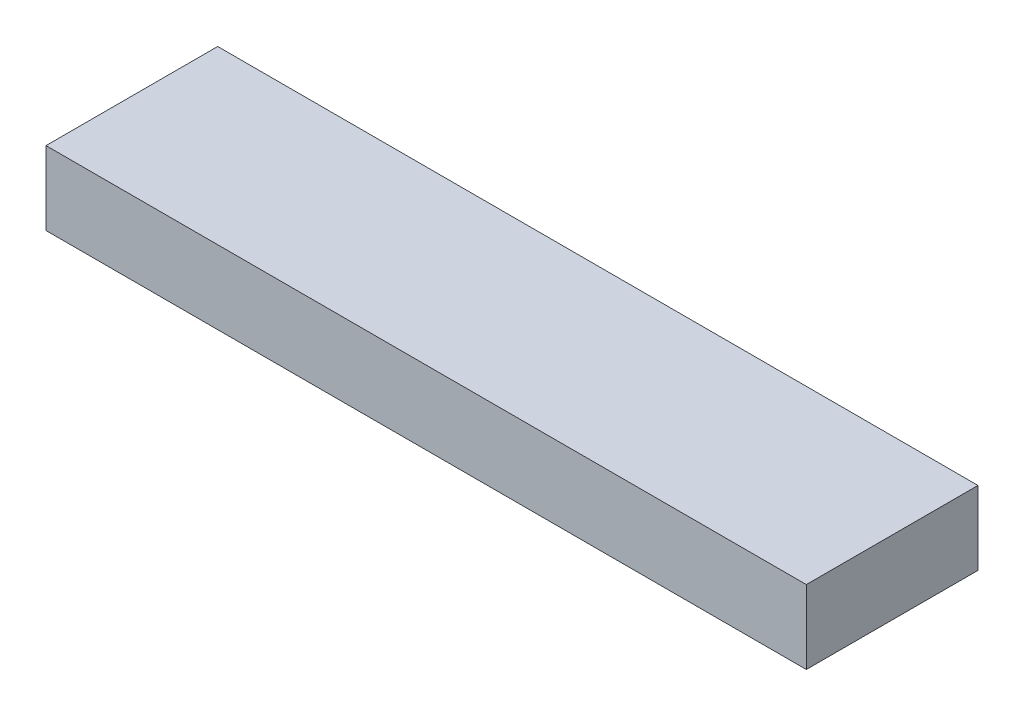
ISO-10303-21;
HEADER;
FILE_DESCRIPTION(('STEP AP214'),'2;1');
FILE_NAME('part.step','',(''),(''),'','','');
FILE_SCHEMA(('AUTOMOTIVE_DESIGN { 1 0 10303 214 1 1 1 1 }'));
ENDSEC;
DATA;
#1=APPLICATION_CONTEXT('core data for automotive mechanical design processes');
#2=APPLICATION_PROTOCOL_DEFINITION('international standard','automotive_design',2000,#1);
#3=PRODUCT_CONTEXT('',#1,'mechanical');
#4=PRODUCT('Part','Part','',(#3));
#5=PRODUCT_RELATED_PRODUCT_CATEGORY('part','',(#4));
#6=PRODUCT_DEFINITION_FORMATION('','',#4);
#7=PRODUCT_DEFINITION_CONTEXT('part definition',#1,'design');
#8=PRODUCT_DEFINITION('design','',#6,#7);
#9=PRODUCT_DEFINITION_SHAPE('','',#8);
#10=(LENGTH_UNIT() NAMED_UNIT(*) SI_UNIT(.MILLI.,.METRE.));
#11=(NAMED_UNIT(*) PLANE_ANGLE_UNIT() SI_UNIT($,.RADIAN.));
#12=(NAMED_UNIT(*) SI_UNIT($,.STERADIAN.) SOLID_ANGLE_UNIT());
#13=UNCERTAINTY_MEASURE_WITH_UNIT(LENGTH_MEASURE(1.E-05),#10,'distance_accuracy_value','');
#14=(GEOMETRIC_REPRESENTATION_CONTEXT(3) GLOBAL_UNCERTAINTY_ASSIGNED_CONTEXT((#13)) GLOBAL_UNIT_ASSIGNED_CONTEXT((#10,
#11,#12)) REPRESENTATION_CONTEXT('',''));
#15=CARTESIAN_POINT('',(0.,0.,0.));
#16=DIRECTION('',(0.,0.,1.));
#17=DIRECTION('',(1.,0.,0.));
#18=AXIS2_PLACEMENT_3D('',#15,#16,#17);
#19=CARTESIAN_POINT('',(0.,38.1,0.));
#20=DIRECTION('',(1.,0.,0.));
#21=DIRECTION('',(0.,0.,-1.));
#22=AXIS2_PLACEMENT_3D('',#19,#20,#21);
#23=PLANE('',#22);
#24=DIRECTION('',(0.,0.,1.));
#25=VECTOR('',#24,1.);
#26=CARTESIAN_POINT('',(0.,0.,0.));
#27=LINE('',#26,#25);
#28=CARTESIAN_POINT('',(0.,0.,-88.9));
#29=VERTEX_POINT('',#28);
#30=CARTESIAN_POINT('',(0.,0.,0.));
#31=VERTEX_POINT('',#30);
#32=EDGE_CURVE('E94',#29,#31,#27,.T.);
#33=ORIENTED_EDGE('',*,*,#32,.T.);
#34=DIRECTION('',(0.,-1.,0.));
#35=VECTOR('',#34,1.);
#36=CARTESIAN_POINT('',(0.,38.1,0.));
#37=LINE('',#36,#35);
#38=CARTESIAN_POINT('',(0.,38.1,0.));
#39=VERTEX_POINT('',#38);
#40=EDGE_CURVE('E11',#39,#31,#37,.T.);
#41=ORIENTED_EDGE('',*,*,#40,.F.);
#42=DIRECTION('',(0.,0.,1.));
#43=VECTOR('',#42,1.);
#44=CARTESIAN_POINT('',(0.,38.1,0.));
#45=LINE('',#44,#43);
#46=CARTESIAN_POINT('',(0.,38.1,-88.9));
#47=VERTEX_POINT('',#46);
#48=EDGE_CURVE('E82',#47,#39,#45,.T.);
#49=ORIENTED_EDGE('',*,*,#48,.F.);
#50=DIRECTION('',(0.,-1.,0.));
#51=VECTOR('',#50,1.);
#52=CARTESIAN_POINT('',(0.,38.1,-88.9));
#53=LINE('',#52,#51);
#54=EDGE_CURVE('E90',#47,#29,#53,.T.);
#55=ORIENTED_EDGE('',*,*,#54,.T.);
#56=EDGE_LOOP('',(#33,#41,#49,#55));
#57=FACE_BOUND('',#56,.T.);
#58=ADVANCED_FACE('F31',(#57),#23,.F.);
#59=CARTESIAN_POINT('',(0.,38.1,0.));
#60=DIRECTION('',(0.,0.,-1.));
#61=DIRECTION('',(-1.,0.,0.));
#62=AXIS2_PLACEMENT_3D('',#59,#60,#61);
#63=PLANE('',#62);
#64=DIRECTION('',(1.,0.,0.));
#65=VECTOR('',#64,1.);
#66=CARTESIAN_POINT('',(0.,0.,0.));
#67=LINE('',#66,#65);
#68=CARTESIAN_POINT('',(393.7,0.,0.));
#69=VERTEX_POINT('',#68);
#70=EDGE_CURVE('E86',#31,#69,#67,.T.);
#71=ORIENTED_EDGE('',*,*,#70,.T.);
#72=DIRECTION('',(0.,-1.,0.));
#73=VECTOR('',#72,1.);
#74=CARTESIAN_POINT('',(393.7,38.1,0.));
#75=LINE('',#74,#73);
#76=CARTESIAN_POINT('',(393.7,38.1,0.));
#77=VERTEX_POINT('',#76);
#78=EDGE_CURVE('E39',#77,#69,#75,.T.);
#79=ORIENTED_EDGE('',*,*,#78,.F.);
#80=DIRECTION('',(1.,0.,0.));
#81=VECTOR('',#80,1.);
#82=CARTESIAN_POINT('',(0.,38.1,0.));
#83=LINE('',#82,#81);
#84=EDGE_CURVE('E77',#39,#77,#83,.T.);
#85=ORIENTED_EDGE('',*,*,#84,.F.);
#86=ORIENTED_EDGE('',*,*,#40,.T.);
#87=EDGE_LOOP('',(#71,#79,#85,#86));
#88=FACE_BOUND('',#87,.T.);
#89=ADVANCED_FACE('F85',(#88),#63,.F.);
#90=CARTESIAN_POINT('',(393.7,38.1,0.));
#91=DIRECTION('',(-1.,0.,0.));
#92=DIRECTION('',(0.,0.,1.));
#93=AXIS2_PLACEMENT_3D('',#90,#91,#92);
#94=PLANE('',#93);
#95=DIRECTION('',(0.,0.,-1.));
#96=VECTOR('',#95,1.);
#97=CARTESIAN_POINT('',(393.7,0.,0.));
#98=LINE('',#97,#96);
#99=CARTESIAN_POINT('',(393.7,0.,-88.9));
#100=VERTEX_POINT('',#99);
#101=EDGE_CURVE('E64',#69,#100,#98,.T.);
#102=ORIENTED_EDGE('',*,*,#101,.T.);
#103=DIRECTION('',(0.,-1.,0.));
#104=VECTOR('',#103,1.);
#105=CARTESIAN_POINT('',(393.7,38.1,-88.9));
#106=LINE('',#105,#104);
#107=CARTESIAN_POINT('',(393.7,38.1,-88.9));
#108=VERTEX_POINT('',#107);
#109=EDGE_CURVE('E87',#108,#100,#106,.T.);
#110=ORIENTED_EDGE('',*,*,#109,.F.);
#111=DIRECTION('',(0.,0.,-1.));
#112=VECTOR('',#111,1.);
#113=CARTESIAN_POINT('',(393.7,38.1,0.));
#114=LINE('',#113,#112);
#115=EDGE_CURVE('E80',#77,#108,#114,.T.);
#116=ORIENTED_EDGE('',*,*,#115,.F.);
#117=ORIENTED_EDGE('',*,*,#78,.T.);
#118=EDGE_LOOP('',(#102,#110,#116,#117));
#119=FACE_BOUND('',#118,.T.);
#120=ADVANCED_FACE('F88',(#119),#94,.F.);
#121=CARTESIAN_POINT('',(0.,38.1,-88.9));
#122=DIRECTION('',(0.,0.,1.));
#123=DIRECTION('',(1.,0.,0.));
#124=AXIS2_PLACEMENT_3D('',#121,#122,#123);
#125=PLANE('',#124);
#126=DIRECTION('',(-1.,0.,0.));
#127=VECTOR('',#126,1.);
#128=CARTESIAN_POINT('',(0.,0.,-88.9));
#129=LINE('',#128,#127);
#130=EDGE_CURVE('E70',#100,#29,#129,.T.);
#131=ORIENTED_EDGE('',*,*,#130,.T.);
#132=ORIENTED_EDGE('',*,*,#54,.F.);
#133=DIRECTION('',(-1.,0.,0.));
#134=VECTOR('',#133,1.);
#135=CARTESIAN_POINT('',(0.,38.1,-88.9));
#136=LINE('',#135,#134);
#137=EDGE_CURVE('E47',#108,#47,#136,.T.);
#138=ORIENTED_EDGE('',*,*,#137,.F.);
#139=ORIENTED_EDGE('',*,*,#109,.T.);
#140=EDGE_LOOP('',(#131,#132,#138,#139));
#141=FACE_BOUND('',#140,.T.);
#142=ADVANCED_FACE('F101',(#141),#125,.F.);
#143=CARTESIAN_POINT('',(0.,38.1,-88.9));
#144=DIRECTION('',(0.,-1.,0.));
#145=DIRECTION('',(0.,0.,-1.));
#146=AXIS2_PLACEMENT_3D('',#143,#144,#145);
#147=PLANE('',#146);
#148=ORIENTED_EDGE('',*,*,#48,.T.);
#149=ORIENTED_EDGE('',*,*,#84,.T.);
#150=ORIENTED_EDGE('',*,*,#115,.T.);
#151=ORIENTED_EDGE('',*,*,#137,.T.);
#152=EDGE_LOOP('',(#148,#149,#150,#151));
#153=FACE_BOUND('',#152,.T.);
#154=ADVANCED_FACE('F78',(#153),#147,.F.);
#155=CARTESIAN_POINT('',(0.,0.,-88.9));
#156=DIRECTION('',(0.,-1.,0.));
#157=DIRECTION('',(0.,0.,-1.));
#158=AXIS2_PLACEMENT_3D('',#155,#156,#157);
#159=PLANE('',#158);
#160=ORIENTED_EDGE('',*,*,#32,.F.);
#161=ORIENTED_EDGE('',*,*,#130,.F.);
#162=ORIENTED_EDGE('',*,*,#101,.F.);
#163=ORIENTED_EDGE('',*,*,#70,.F.);
#164=EDGE_LOOP('',(#160,#161,#162,#163));
#165=FACE_BOUND('',#164,.T.);
#166=ADVANCED_FACE('F104',(#165),#159,.T.);
#167=CLOSED_SHELL('',(#58,#89,#120,#142,#154,#166));
#168=MANIFOLD_SOLID_BREP('B2',#167);
#169=ADVANCED_BREP_SHAPE_REPRESENTATION('',(#18,#168),#14);
#170=SHAPE_DEFINITION_REPRESENTATION(#9,#169);
ENDSEC;
END-ISO-10303-21;
